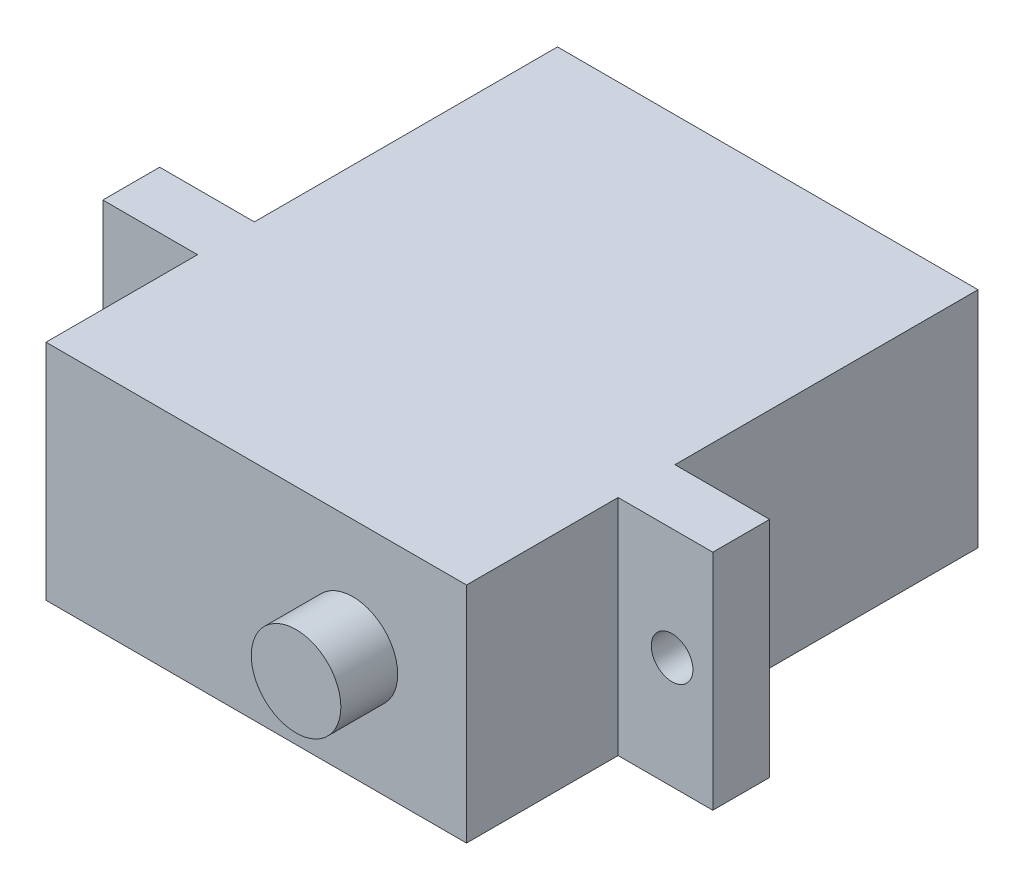
ISO-10303-21;
HEADER;
FILE_DESCRIPTION(('STEP AP214'),'2;1');
FILE_NAME('part.step','',(''),(''),'','','');
FILE_SCHEMA(('AUTOMOTIVE_DESIGN { 1 0 10303 214 1 1 1 1 }'));
ENDSEC;
DATA;
#1=APPLICATION_CONTEXT('core data for automotive mechanical design processes');
#2=APPLICATION_PROTOCOL_DEFINITION('international standard','automotive_design',2000,#1);
#3=PRODUCT_CONTEXT('',#1,'mechanical');
#4=PRODUCT('Part','Part','',(#3));
#5=PRODUCT_RELATED_PRODUCT_CATEGORY('part','',(#4));
#6=PRODUCT_DEFINITION_FORMATION('','',#4);
#7=PRODUCT_DEFINITION_CONTEXT('part definition',#1,'design');
#8=PRODUCT_DEFINITION('design','',#6,#7);
#9=PRODUCT_DEFINITION_SHAPE('','',#8);
#10=(LENGTH_UNIT() NAMED_UNIT(*) SI_UNIT(.MILLI.,.METRE.));
#11=(NAMED_UNIT(*) PLANE_ANGLE_UNIT() SI_UNIT($,.RADIAN.));
#12=(NAMED_UNIT(*) SI_UNIT($,.STERADIAN.) SOLID_ANGLE_UNIT());
#13=UNCERTAINTY_MEASURE_WITH_UNIT(LENGTH_MEASURE(1.E-05),#10,'distance_accuracy_value','');
#14=(GEOMETRIC_REPRESENTATION_CONTEXT(3) GLOBAL_UNCERTAINTY_ASSIGNED_CONTEXT((#13)) GLOBAL_UNIT_ASSIGNED_CONTEXT((#10,
#11,#12)) REPRESENTATION_CONTEXT('',''));
#15=CARTESIAN_POINT('',(0.,0.,0.));
#16=DIRECTION('',(0.,0.,1.));
#17=DIRECTION('',(1.,0.,0.));
#18=AXIS2_PLACEMENT_3D('',#15,#16,#17);
#19=CARTESIAN_POINT('',(0.,0.,0.));
#20=DIRECTION('',(0.,0.,1.));
#21=DIRECTION('',(1.,0.,0.));
#22=AXIS2_PLACEMENT_3D('',#19,#20,#21);
#23=PLANE('',#22);
#24=CARTESIAN_POINT('',(5.1,5.9,0.));
#25=DIRECTION('',(0.,0.,1.));
#26=DIRECTION('',(1.,0.,0.));
#27=AXIS2_PLACEMENT_3D('',#24,#25,#26);
#28=CIRCLE('',#27,2.365);
#29=CARTESIAN_POINT('',(7.465,5.9,0.));
#30=VERTEX_POINT('',#29);
#31=EDGE_CURVE('E179',#30,#30,#28,.T.);
#32=ORIENTED_EDGE('',*,*,#31,.F.);
#33=EDGE_LOOP('',(#32));
#34=FACE_BOUND('',#33,.T.);
#35=DIRECTION('',(1.,0.,0.));
#36=VECTOR('',#35,1.);
#37=CARTESIAN_POINT('',(-16.1,0.,0.));
#38=LINE('',#37,#36);
#39=CARTESIAN_POINT('',(-11.1,0.,0.));
#40=VERTEX_POINT('',#39);
#41=CARTESIAN_POINT('',(11.1,0.,0.));
#42=VERTEX_POINT('',#41);
#43=EDGE_CURVE('E147',#40,#42,#38,.T.);
#44=ORIENTED_EDGE('',*,*,#43,.T.);
#45=DIRECTION('',(0.,-1.,0.));
#46=VECTOR('',#45,1.);
#47=CARTESIAN_POINT('',(11.1,11.8,0.));
#48=LINE('',#47,#46);
#49=CARTESIAN_POINT('',(11.1,11.8,0.));
#50=VERTEX_POINT('',#49);
#51=EDGE_CURVE('E134',#50,#42,#48,.T.);
#52=ORIENTED_EDGE('',*,*,#51,.F.);
#53=DIRECTION('',(-1.,0.,0.));
#54=VECTOR('',#53,1.);
#55=CARTESIAN_POINT('',(16.1,11.8,0.));
#56=LINE('',#55,#54);
#57=CARTESIAN_POINT('',(-11.1,11.8,0.));
#58=VERTEX_POINT('',#57);
#59=EDGE_CURVE('E154',#50,#58,#56,.T.);
#60=ORIENTED_EDGE('',*,*,#59,.T.);
#61=DIRECTION('',(0.,1.,0.));
#62=VECTOR('',#61,1.);
#63=CARTESIAN_POINT('',(-11.1,11.8,0.));
#64=LINE('',#63,#62);
#65=EDGE_CURVE('E152',#40,#58,#64,.T.);
#66=ORIENTED_EDGE('',*,*,#65,.F.);
#67=EDGE_LOOP('',(#44,#52,#60,#66));
#68=FACE_BOUND('',#67,.T.);
#69=ADVANCED_FACE('F42',(#34,#68),#23,.T.);
#70=CARTESIAN_POINT('',(0.,0.,-27.));
#71=DIRECTION('',(0.,0.,1.));
#72=DIRECTION('',(1.,0.,0.));
#73=AXIS2_PLACEMENT_3D('',#70,#71,#72);
#74=PLANE('',#73);
#75=DIRECTION('',(0.,-1.,0.));
#76=VECTOR('',#75,1.);
#77=CARTESIAN_POINT('',(-11.1,11.8,-27.));
#78=LINE('',#77,#76);
#79=CARTESIAN_POINT('',(-11.1,11.8,-27.));
#80=VERTEX_POINT('',#79);
#81=CARTESIAN_POINT('',(-11.1,0.,-27.));
#82=VERTEX_POINT('',#81);
#83=EDGE_CURVE('E208',#80,#82,#78,.T.);
#84=ORIENTED_EDGE('',*,*,#83,.F.);
#85=DIRECTION('',(-1.,0.,0.));
#86=VECTOR('',#85,1.);
#87=CARTESIAN_POINT('',(16.1,11.8,-27.));
#88=LINE('',#87,#86);
#89=CARTESIAN_POINT('',(11.1,11.8,-27.));
#90=VERTEX_POINT('',#89);
#91=EDGE_CURVE('E153',#90,#80,#88,.T.);
#92=ORIENTED_EDGE('',*,*,#91,.F.);
#93=DIRECTION('',(0.,1.,0.));
#94=VECTOR('',#93,1.);
#95=CARTESIAN_POINT('',(11.1,11.8,-27.));
#96=LINE('',#95,#94);
#97=CARTESIAN_POINT('',(11.1,0.,-27.));
#98=VERTEX_POINT('',#97);
#99=EDGE_CURVE('E192',#98,#90,#96,.T.);
#100=ORIENTED_EDGE('',*,*,#99,.F.);
#101=DIRECTION('',(1.,0.,0.));
#102=VECTOR('',#101,1.);
#103=CARTESIAN_POINT('',(-16.1,0.,-27.));
#104=LINE('',#103,#102);
#105=EDGE_CURVE('E157',#82,#98,#104,.T.);
#106=ORIENTED_EDGE('',*,*,#105,.F.);
#107=EDGE_LOOP('',(#84,#92,#100,#106));
#108=FACE_BOUND('',#107,.T.);
#109=ADVANCED_FACE('F276',(#108),#74,.F.);
#110=CARTESIAN_POINT('',(16.1,11.8,-27.));
#111=DIRECTION('',(0.,1.,0.));
#112=DIRECTION('',(-1.,0.,0.));
#113=AXIS2_PLACEMENT_3D('',#110,#111,#112);
#114=PLANE('',#113);
#115=DIRECTION('',(1.,0.,0.));
#116=VECTOR('',#115,1.);
#117=CARTESIAN_POINT('',(11.1,11.8,-8.));
#118=LINE('',#117,#116);
#119=CARTESIAN_POINT('',(11.1,11.8,-8.));
#120=VERTEX_POINT('',#119);
#121=CARTESIAN_POINT('',(16.1,11.8,-8.));
#122=VERTEX_POINT('',#121);
#123=EDGE_CURVE('E224',#120,#122,#118,.T.);
#124=ORIENTED_EDGE('',*,*,#123,.T.);
#125=DIRECTION('',(0.,0.,1.));
#126=VECTOR('',#125,1.);
#127=CARTESIAN_POINT('',(16.1,11.8,-27.));
#128=LINE('',#127,#126);
#129=CARTESIAN_POINT('',(16.1,11.8,-11.));
#130=VERTEX_POINT('',#129);
#131=EDGE_CURVE('E11',#130,#122,#128,.T.);
#132=ORIENTED_EDGE('',*,*,#131,.F.);
#133=DIRECTION('',(1.,0.,0.));
#134=VECTOR('',#133,1.);
#135=CARTESIAN_POINT('',(11.1,11.8,-11.));
#136=LINE('',#135,#134);
#137=CARTESIAN_POINT('',(11.1,11.8,-11.));
#138=VERTEX_POINT('',#137);
#139=EDGE_CURVE('E185',#138,#130,#136,.T.);
#140=ORIENTED_EDGE('',*,*,#139,.F.);
#141=DIRECTION('',(0.,0.,1.));
#142=VECTOR('',#141,1.);
#143=CARTESIAN_POINT('',(11.1,11.8,-27.));
#144=LINE('',#143,#142);
#145=EDGE_CURVE('E198',#90,#138,#144,.T.);
#146=ORIENTED_EDGE('',*,*,#145,.F.);
#147=ORIENTED_EDGE('',*,*,#91,.T.);
#148=DIRECTION('',(0.,0.,-1.));
#149=VECTOR('',#148,1.);
#150=CARTESIAN_POINT('',(-11.1,11.8,-27.));
#151=LINE('',#150,#149);
#152=CARTESIAN_POINT('',(-11.1,11.8,-11.));
#153=VERTEX_POINT('',#152);
#154=EDGE_CURVE('E204',#153,#80,#151,.T.);
#155=ORIENTED_EDGE('',*,*,#154,.F.);
#156=DIRECTION('',(-1.,0.,0.));
#157=VECTOR('',#156,1.);
#158=CARTESIAN_POINT('',(-11.1,11.8,-11.));
#159=LINE('',#158,#157);
#160=CARTESIAN_POINT('',(-16.1,11.8,-11.));
#161=VERTEX_POINT('',#160);
#162=EDGE_CURVE('E193',#153,#161,#159,.T.);
#163=ORIENTED_EDGE('',*,*,#162,.T.);
#164=DIRECTION('',(0.,0.,1.));
#165=VECTOR('',#164,1.);
#166=CARTESIAN_POINT('',(-16.1,11.8,-27.));
#167=LINE('',#166,#165);
#168=CARTESIAN_POINT('',(-16.1,11.8,-8.));
#169=VERTEX_POINT('',#168);
#170=EDGE_CURVE('E46',#161,#169,#167,.T.);
#171=ORIENTED_EDGE('',*,*,#170,.T.);
#172=DIRECTION('',(-1.,0.,0.));
#173=VECTOR('',#172,1.);
#174=CARTESIAN_POINT('',(-11.1,11.8,-8.));
#175=LINE('',#174,#173);
#176=CARTESIAN_POINT('',(-11.1,11.8,-8.));
#177=VERTEX_POINT('',#176);
#178=EDGE_CURVE('E218',#177,#169,#175,.T.);
#179=ORIENTED_EDGE('',*,*,#178,.F.);
#180=DIRECTION('',(0.,0.,-1.));
#181=VECTOR('',#180,1.);
#182=CARTESIAN_POINT('',(-11.1,11.8,0.));
#183=LINE('',#182,#181);
#184=EDGE_CURVE('E228',#58,#177,#183,.T.);
#185=ORIENTED_EDGE('',*,*,#184,.F.);
#186=ORIENTED_EDGE('',*,*,#59,.F.);
#187=DIRECTION('',(0.,0.,1.));
#188=VECTOR('',#187,1.);
#189=CARTESIAN_POINT('',(11.1,11.8,0.));
#190=LINE('',#189,#188);
#191=EDGE_CURVE('E59',#120,#50,#190,.T.);
#192=ORIENTED_EDGE('',*,*,#191,.F.);
#193=EDGE_LOOP('',(#124,#132,#140,#146,#147,#155,#163,#171,#179,#185,#186,#192));
#194=FACE_BOUND('',#193,.T.);
#195=ADVANCED_FACE('F44',(#194),#114,.T.);
#196=CARTESIAN_POINT('',(16.1,0.,-27.));
#197=DIRECTION('',(1.,0.,0.));
#198=DIRECTION('',(0.,0.,-1.));
#199=AXIS2_PLACEMENT_3D('',#196,#197,#198);
#200=PLANE('',#199);
#201=DIRECTION('',(0.,1.,0.));
#202=VECTOR('',#201,1.);
#203=CARTESIAN_POINT('',(16.1,11.8,-8.));
#204=LINE('',#203,#202);
#205=CARTESIAN_POINT('',(16.1,0.,-8.));
#206=VERTEX_POINT('',#205);
#207=EDGE_CURVE('E142',#206,#122,#204,.T.);
#208=ORIENTED_EDGE('',*,*,#207,.F.);
#209=DIRECTION('',(0.,0.,1.));
#210=VECTOR('',#209,1.);
#211=CARTESIAN_POINT('',(16.1,0.,-27.));
#212=LINE('',#211,#210);
#213=CARTESIAN_POINT('',(16.1,0.,-11.));
#214=VERTEX_POINT('',#213);
#215=EDGE_CURVE('E51',#214,#206,#212,.T.);
#216=ORIENTED_EDGE('',*,*,#215,.F.);
#217=DIRECTION('',(0.,-1.,0.));
#218=VECTOR('',#217,1.);
#219=CARTESIAN_POINT('',(16.1,11.8,-11.));
#220=LINE('',#219,#218);
#221=EDGE_CURVE('E190',#130,#214,#220,.T.);
#222=ORIENTED_EDGE('',*,*,#221,.F.);
#223=ORIENTED_EDGE('',*,*,#131,.T.);
#224=EDGE_LOOP('',(#208,#216,#222,#223));
#225=FACE_BOUND('',#224,.T.);
#226=ADVANCED_FACE('F273',(#225),#200,.T.);
#227=CARTESIAN_POINT('',(-16.1,0.,-27.));
#228=DIRECTION('',(0.,-1.,0.));
#229=DIRECTION('',(0.,0.,-1.));
#230=AXIS2_PLACEMENT_3D('',#227,#228,#229);
#231=PLANE('',#230);
#232=DIRECTION('',(1.,0.,0.));
#233=VECTOR('',#232,1.);
#234=CARTESIAN_POINT('',(11.1,0.,-8.));
#235=LINE('',#234,#233);
#236=CARTESIAN_POINT('',(11.1,0.,-8.));
#237=VERTEX_POINT('',#236);
#238=EDGE_CURVE('E149',#237,#206,#235,.T.);
#239=ORIENTED_EDGE('',*,*,#238,.F.);
#240=DIRECTION('',(0.,0.,-1.));
#241=VECTOR('',#240,1.);
#242=CARTESIAN_POINT('',(11.1,0.,0.));
#243=LINE('',#242,#241);
#244=EDGE_CURVE('E137',#42,#237,#243,.T.);
#245=ORIENTED_EDGE('',*,*,#244,.F.);
#246=ORIENTED_EDGE('',*,*,#43,.F.);
#247=DIRECTION('',(0.,0.,1.));
#248=VECTOR('',#247,1.);
#249=CARTESIAN_POINT('',(-11.1,0.,0.));
#250=LINE('',#249,#248);
#251=CARTESIAN_POINT('',(-11.1,0.,-8.));
#252=VERTEX_POINT('',#251);
#253=EDGE_CURVE('E67',#252,#40,#250,.T.);
#254=ORIENTED_EDGE('',*,*,#253,.F.);
#255=DIRECTION('',(-1.,0.,0.));
#256=VECTOR('',#255,1.);
#257=CARTESIAN_POINT('',(-11.1,0.,-8.));
#258=LINE('',#257,#256);
#259=CARTESIAN_POINT('',(-16.1,0.,-8.));
#260=VERTEX_POINT('',#259);
#261=EDGE_CURVE('E209',#252,#260,#258,.T.);
#262=ORIENTED_EDGE('',*,*,#261,.T.);
#263=DIRECTION('',(0.,0.,1.));
#264=VECTOR('',#263,1.);
#265=CARTESIAN_POINT('',(-16.1,0.,-27.));
#266=LINE('',#265,#264);
#267=CARTESIAN_POINT('',(-16.1,0.,-11.));
#268=VERTEX_POINT('',#267);
#269=EDGE_CURVE('E163',#268,#260,#266,.T.);
#270=ORIENTED_EDGE('',*,*,#269,.F.);
#271=DIRECTION('',(-1.,0.,0.));
#272=VECTOR('',#271,1.);
#273=CARTESIAN_POINT('',(-11.1,0.,-11.));
#274=LINE('',#273,#272);
#275=CARTESIAN_POINT('',(-11.1,0.,-11.));
#276=VERTEX_POINT('',#275);
#277=EDGE_CURVE('E202',#276,#268,#274,.T.);
#278=ORIENTED_EDGE('',*,*,#277,.F.);
#279=DIRECTION('',(0.,0.,1.));
#280=VECTOR('',#279,1.);
#281=CARTESIAN_POINT('',(-11.1,0.,-27.));
#282=LINE('',#281,#280);
#283=EDGE_CURVE('E214',#82,#276,#282,.T.);
#284=ORIENTED_EDGE('',*,*,#283,.F.);
#285=ORIENTED_EDGE('',*,*,#105,.T.);
#286=DIRECTION('',(0.,0.,-1.));
#287=VECTOR('',#286,1.);
#288=CARTESIAN_POINT('',(11.1,0.,-27.));
#289=LINE('',#288,#287);
#290=CARTESIAN_POINT('',(11.1,0.,-11.));
#291=VERTEX_POINT('',#290);
#292=EDGE_CURVE('E187',#291,#98,#289,.T.);
#293=ORIENTED_EDGE('',*,*,#292,.F.);
#294=DIRECTION('',(1.,0.,0.));
#295=VECTOR('',#294,1.);
#296=CARTESIAN_POINT('',(11.1,0.,-11.));
#297=LINE('',#296,#295);
#298=EDGE_CURVE('E182',#291,#214,#297,.T.);
#299=ORIENTED_EDGE('',*,*,#298,.T.);
#300=ORIENTED_EDGE('',*,*,#215,.T.);
#301=EDGE_LOOP('',(#239,#245,#246,#254,#262,#270,#278,#284,#285,#293,#299,#300));
#302=FACE_BOUND('',#301,.T.);
#303=ADVANCED_FACE('F146',(#302),#231,.T.);
#304=CARTESIAN_POINT('',(-16.1,11.8,-27.));
#305=DIRECTION('',(-1.,0.,0.));
#306=DIRECTION('',(0.,0.,1.));
#307=AXIS2_PLACEMENT_3D('',#304,#305,#306);
#308=PLANE('',#307);
#309=DIRECTION('',(0.,-1.,0.));
#310=VECTOR('',#309,1.);
#311=CARTESIAN_POINT('',(-16.1,11.8,-8.));
#312=LINE('',#311,#310);
#313=EDGE_CURVE('E222',#169,#260,#312,.T.);
#314=ORIENTED_EDGE('',*,*,#313,.F.);
#315=ORIENTED_EDGE('',*,*,#170,.F.);
#316=DIRECTION('',(0.,1.,0.));
#317=VECTOR('',#316,1.);
#318=CARTESIAN_POINT('',(-16.1,11.8,-11.));
#319=LINE('',#318,#317);
#320=EDGE_CURVE('E206',#268,#161,#319,.T.);
#321=ORIENTED_EDGE('',*,*,#320,.F.);
#322=ORIENTED_EDGE('',*,*,#269,.T.);
#323=EDGE_LOOP('',(#314,#315,#321,#322));
#324=FACE_BOUND('',#323,.T.);
#325=ADVANCED_FACE('F263',(#324),#308,.T.);
#326=CARTESIAN_POINT('',(5.1,5.9,3.));
#327=DIRECTION('',(0.,0.,-1.));
#328=DIRECTION('',(-1.,0.,0.));
#329=AXIS2_PLACEMENT_3D('',#326,#327,#328);
#330=CYLINDRICAL_SURFACE('',#329,2.365);
#331=CARTESIAN_POINT('',(5.1,5.9,3.));
#332=DIRECTION('',(0.,0.,1.));
#333=DIRECTION('',(1.,0.,0.));
#334=AXIS2_PLACEMENT_3D('',#331,#332,#333);
#335=CIRCLE('',#334,2.365);
#336=CARTESIAN_POINT('',(7.465,5.9,3.));
#337=VERTEX_POINT('',#336);
#338=EDGE_CURVE('E159',#337,#337,#335,.T.);
#339=ORIENTED_EDGE('',*,*,#338,.F.);
#340=EDGE_LOOP('',(#339));
#341=FACE_BOUND('',#340,.T.);
#342=ORIENTED_EDGE('',*,*,#31,.T.);
#343=EDGE_LOOP('',(#342));
#344=FACE_BOUND('',#343,.T.);
#345=ADVANCED_FACE('F265',(#341,#344),#330,.T.);
#346=CARTESIAN_POINT('',(5.1,5.9,3.));
#347=DIRECTION('',(0.,0.,1.));
#348=DIRECTION('',(1.,0.,0.));
#349=AXIS2_PLACEMENT_3D('',#346,#347,#348);
#350=PLANE('',#349);
#351=ORIENTED_EDGE('',*,*,#338,.T.);
#352=EDGE_LOOP('',(#351));
#353=FACE_BOUND('',#352,.T.);
#354=ADVANCED_FACE('F270',(#353),#350,.T.);
#355=CARTESIAN_POINT('',(11.1,11.8,-11.));
#356=DIRECTION('',(0.,0.,1.));
#357=DIRECTION('',(1.,0.,0.));
#358=AXIS2_PLACEMENT_3D('',#355,#356,#357);
#359=PLANE('',#358);
#360=CARTESIAN_POINT('',(13.95,5.9,-11.));
#361=DIRECTION('',(0.,0.,1.));
#362=DIRECTION('',(1.,0.,0.));
#363=AXIS2_PLACEMENT_3D('',#360,#361,#362);
#364=CIRCLE('',#363,1.1);
#365=CARTESIAN_POINT('',(15.05,5.9,-11.));
#366=VERTEX_POINT('',#365);
#367=EDGE_CURVE('E243',#366,#366,#364,.F.);
#368=ORIENTED_EDGE('',*,*,#367,.F.);
#369=EDGE_LOOP('',(#368));
#370=FACE_BOUND('',#369,.T.);
#371=ORIENTED_EDGE('',*,*,#221,.T.);
#372=ORIENTED_EDGE('',*,*,#298,.F.);
#373=DIRECTION('',(0.,-1.,0.));
#374=VECTOR('',#373,1.);
#375=CARTESIAN_POINT('',(11.1,11.8,-11.));
#376=LINE('',#375,#374);
#377=EDGE_CURVE('E195',#138,#291,#376,.T.);
#378=ORIENTED_EDGE('',*,*,#377,.F.);
#379=ORIENTED_EDGE('',*,*,#139,.T.);
#380=EDGE_LOOP('',(#371,#372,#378,#379));
#381=FACE_BOUND('',#380,.T.);
#382=ADVANCED_FACE('F298',(#370,#381),#359,.F.);
#383=CARTESIAN_POINT('',(11.1,0.,0.));
#384=DIRECTION('',(-1.,0.,0.));
#385=DIRECTION('',(0.,0.,1.));
#386=AXIS2_PLACEMENT_3D('',#383,#384,#385);
#387=PLANE('',#386);
#388=ORIENTED_EDGE('',*,*,#99,.T.);
#389=ORIENTED_EDGE('',*,*,#145,.T.);
#390=ORIENTED_EDGE('',*,*,#377,.T.);
#391=ORIENTED_EDGE('',*,*,#292,.T.);
#392=EDGE_LOOP('',(#388,#389,#390,#391));
#393=FACE_BOUND('',#392,.T.);
#394=ADVANCED_FACE('F300',(#393),#387,.F.);
#395=CARTESIAN_POINT('',(-11.1,11.8,-11.));
#396=DIRECTION('',(0.,0.,1.));
#397=DIRECTION('',(1.,0.,0.));
#398=AXIS2_PLACEMENT_3D('',#395,#396,#397);
#399=PLANE('',#398);
#400=CARTESIAN_POINT('',(-13.95,5.9,-11.));
#401=DIRECTION('',(0.,0.,1.));
#402=DIRECTION('',(1.,0.,0.));
#403=AXIS2_PLACEMENT_3D('',#400,#401,#402);
#404=CIRCLE('',#403,1.1);
#405=CARTESIAN_POINT('',(-12.85,5.9,-11.));
#406=VERTEX_POINT('',#405);
#407=EDGE_CURVE('E236',#406,#406,#404,.F.);
#408=ORIENTED_EDGE('',*,*,#407,.F.);
#409=EDGE_LOOP('',(#408));
#410=FACE_BOUND('',#409,.T.);
#411=ORIENTED_EDGE('',*,*,#320,.T.);
#412=ORIENTED_EDGE('',*,*,#162,.F.);
#413=DIRECTION('',(0.,1.,0.));
#414=VECTOR('',#413,1.);
#415=CARTESIAN_POINT('',(-11.1,11.8,-11.));
#416=LINE('',#415,#414);
#417=EDGE_CURVE('E211',#276,#153,#416,.T.);
#418=ORIENTED_EDGE('',*,*,#417,.F.);
#419=ORIENTED_EDGE('',*,*,#277,.T.);
#420=EDGE_LOOP('',(#411,#412,#418,#419));
#421=FACE_BOUND('',#420,.T.);
#422=ADVANCED_FACE('F262',(#410,#421),#399,.F.);
#423=CARTESIAN_POINT('',(-11.1,0.,0.));
#424=DIRECTION('',(-1.,0.,0.));
#425=DIRECTION('',(0.,0.,1.));
#426=AXIS2_PLACEMENT_3D('',#423,#424,#425);
#427=PLANE('',#426);
#428=ORIENTED_EDGE('',*,*,#83,.T.);
#429=ORIENTED_EDGE('',*,*,#283,.T.);
#430=ORIENTED_EDGE('',*,*,#417,.T.);
#431=ORIENTED_EDGE('',*,*,#154,.T.);
#432=EDGE_LOOP('',(#428,#429,#430,#431));
#433=FACE_BOUND('',#432,.T.);
#434=ADVANCED_FACE('F258',(#433),#427,.T.);
#435=CARTESIAN_POINT('',(-11.1,11.8,-8.));
#436=DIRECTION('',(0.,0.,-1.));
#437=DIRECTION('',(0.,1.,0.));
#438=AXIS2_PLACEMENT_3D('',#435,#436,#437);
#439=PLANE('',#438);
#440=CARTESIAN_POINT('',(-13.95,5.9,-8.));
#441=DIRECTION('',(0.,0.,1.));
#442=DIRECTION('',(-1.,0.,0.));
#443=AXIS2_PLACEMENT_3D('',#440,#441,#442);
#444=CIRCLE('',#443,1.1);
#445=CARTESIAN_POINT('',(-15.05,5.9,-8.));
#446=VERTEX_POINT('',#445);
#447=EDGE_CURVE('E242',#446,#446,#444,.T.);
#448=ORIENTED_EDGE('',*,*,#447,.F.);
#449=EDGE_LOOP('',(#448));
#450=FACE_BOUND('',#449,.T.);
#451=ORIENTED_EDGE('',*,*,#313,.T.);
#452=ORIENTED_EDGE('',*,*,#261,.F.);
#453=DIRECTION('',(0.,-1.,0.));
#454=VECTOR('',#453,1.);
#455=CARTESIAN_POINT('',(-11.1,11.8,-8.));
#456=LINE('',#455,#454);
#457=EDGE_CURVE('E226',#177,#252,#456,.T.);
#458=ORIENTED_EDGE('',*,*,#457,.F.);
#459=ORIENTED_EDGE('',*,*,#178,.T.);
#460=EDGE_LOOP('',(#451,#452,#458,#459));
#461=FACE_BOUND('',#460,.T.);
#462=ADVANCED_FACE('F254',(#450,#461),#439,.F.);
#463=CARTESIAN_POINT('',(-11.1,0.,0.));
#464=DIRECTION('',(1.,0.,0.));
#465=DIRECTION('',(0.,0.,-1.));
#466=AXIS2_PLACEMENT_3D('',#463,#464,#465);
#467=PLANE('',#466);
#468=ORIENTED_EDGE('',*,*,#65,.T.);
#469=ORIENTED_EDGE('',*,*,#184,.T.);
#470=ORIENTED_EDGE('',*,*,#457,.T.);
#471=ORIENTED_EDGE('',*,*,#253,.T.);
#472=EDGE_LOOP('',(#468,#469,#470,#471));
#473=FACE_BOUND('',#472,.T.);
#474=ADVANCED_FACE('F257',(#473),#467,.F.);
#475=CARTESIAN_POINT('',(11.1,11.8,-8.));
#476=DIRECTION('',(0.,0.,-1.));
#477=DIRECTION('',(0.,1.,0.));
#478=AXIS2_PLACEMENT_3D('',#475,#476,#477);
#479=PLANE('',#478);
#480=CARTESIAN_POINT('',(13.95,5.9,-8.));
#481=DIRECTION('',(0.,0.,1.));
#482=DIRECTION('',(1.,0.,0.));
#483=AXIS2_PLACEMENT_3D('',#480,#481,#482);
#484=CIRCLE('',#483,1.1);
#485=CARTESIAN_POINT('',(15.05,5.9,-8.));
#486=VERTEX_POINT('',#485);
#487=EDGE_CURVE('E239',#486,#486,#484,.T.);
#488=ORIENTED_EDGE('',*,*,#487,.F.);
#489=EDGE_LOOP('',(#488));
#490=FACE_BOUND('',#489,.T.);
#491=ORIENTED_EDGE('',*,*,#207,.T.);
#492=ORIENTED_EDGE('',*,*,#123,.F.);
#493=DIRECTION('',(0.,1.,0.));
#494=VECTOR('',#493,1.);
#495=CARTESIAN_POINT('',(11.1,11.8,-8.));
#496=LINE('',#495,#494);
#497=EDGE_CURVE('E150',#237,#120,#496,.T.);
#498=ORIENTED_EDGE('',*,*,#497,.F.);
#499=ORIENTED_EDGE('',*,*,#238,.T.);
#500=EDGE_LOOP('',(#491,#492,#498,#499));
#501=FACE_BOUND('',#500,.T.);
#502=ADVANCED_FACE('F305',(#490,#501),#479,.F.);
#503=CARTESIAN_POINT('',(11.1,0.,0.));
#504=DIRECTION('',(1.,0.,0.));
#505=DIRECTION('',(0.,0.,-1.));
#506=AXIS2_PLACEMENT_3D('',#503,#504,#505);
#507=PLANE('',#506);
#508=ORIENTED_EDGE('',*,*,#51,.T.);
#509=ORIENTED_EDGE('',*,*,#244,.T.);
#510=ORIENTED_EDGE('',*,*,#497,.T.);
#511=ORIENTED_EDGE('',*,*,#191,.T.);
#512=EDGE_LOOP('',(#508,#509,#510,#511));
#513=FACE_BOUND('',#512,.T.);
#514=ADVANCED_FACE('F136',(#513),#507,.T.);
#515=CARTESIAN_POINT('',(13.95,5.9,-27.001));
#516=DIRECTION('',(0.,0.,1.));
#517=DIRECTION('',(1.,0.,0.));
#518=AXIS2_PLACEMENT_3D('',#515,#516,#517);
#519=CYLINDRICAL_SURFACE('',#518,1.1);
#520=ORIENTED_EDGE('',*,*,#487,.T.);
#521=EDGE_LOOP('',(#520));
#522=FACE_BOUND('',#521,.T.);
#523=ORIENTED_EDGE('',*,*,#367,.T.);
#524=EDGE_LOOP('',(#523));
#525=FACE_BOUND('',#524,.T.);
#526=ADVANCED_FACE('F313',(#522,#525),#519,.F.);
#527=CARTESIAN_POINT('',(-13.95,5.9,-27.001));
#528=DIRECTION('',(0.,0.,1.));
#529=DIRECTION('',(1.,0.,0.));
#530=AXIS2_PLACEMENT_3D('',#527,#528,#529);
#531=CYLINDRICAL_SURFACE('',#530,1.1);
#532=ORIENTED_EDGE('',*,*,#447,.T.);
#533=EDGE_LOOP('',(#532));
#534=FACE_BOUND('',#533,.T.);
#535=ORIENTED_EDGE('',*,*,#407,.T.);
#536=EDGE_LOOP('',(#535));
#537=FACE_BOUND('',#536,.T.);
#538=ADVANCED_FACE('F251',(#534,#537),#531,.F.);
#539=CLOSED_SHELL('',(#69,#109,#195,#226,#303,#325,#345,#354,#382,#394,#422,#434,#462,#474,#502,
#514,#526,#538));
#540=MANIFOLD_SOLID_BREP('B2',#539);
#541=ADVANCED_BREP_SHAPE_REPRESENTATION('',(#18,#540),#14);
#542=SHAPE_DEFINITION_REPRESENTATION(#9,#541);
ENDSEC;
END-ISO-10303-21;
